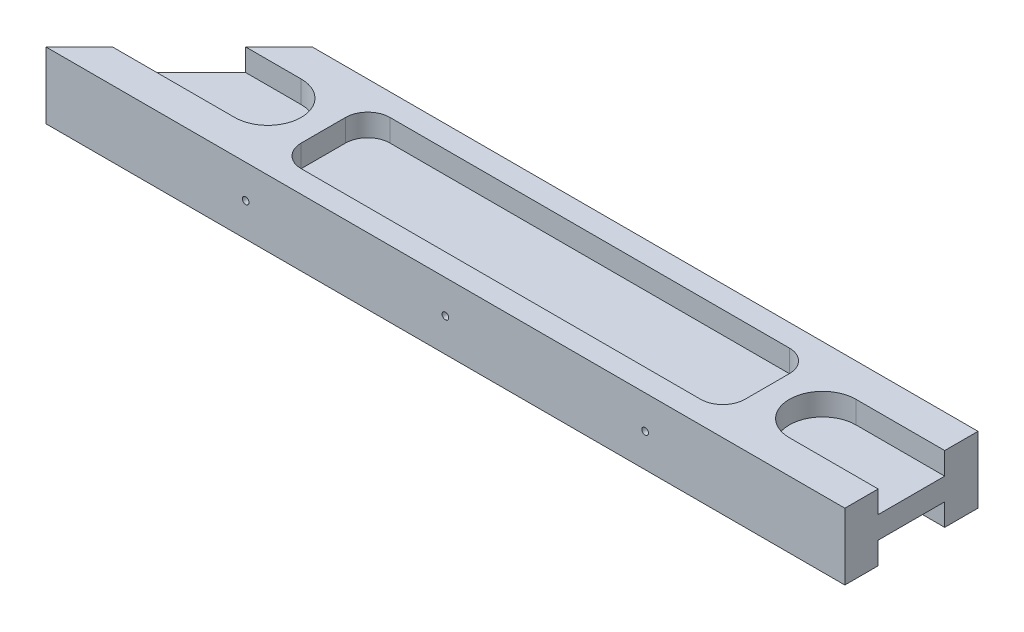
ISO-10303-21;
HEADER;
FILE_DESCRIPTION(('STEP AP214'),'2;1');
FILE_NAME('part.step','',(''),(''),'','','');
FILE_SCHEMA(('AUTOMOTIVE_DESIGN { 1 0 10303 214 1 1 1 1 }'));
ENDSEC;
DATA;
#1=APPLICATION_CONTEXT('core data for automotive mechanical design processes');
#2=APPLICATION_PROTOCOL_DEFINITION('international standard','automotive_design',2000,#1);
#3=PRODUCT_CONTEXT('',#1,'mechanical');
#4=PRODUCT('Part','Part','',(#3));
#5=PRODUCT_RELATED_PRODUCT_CATEGORY('part','',(#4));
#6=PRODUCT_DEFINITION_FORMATION('','',#4);
#7=PRODUCT_DEFINITION_CONTEXT('part definition',#1,'design');
#8=PRODUCT_DEFINITION('design','',#6,#7);
#9=PRODUCT_DEFINITION_SHAPE('','',#8);
#10=(LENGTH_UNIT() NAMED_UNIT(*) SI_UNIT(.MILLI.,.METRE.));
#11=(NAMED_UNIT(*) PLANE_ANGLE_UNIT() SI_UNIT($,.RADIAN.));
#12=(NAMED_UNIT(*) SI_UNIT($,.STERADIAN.) SOLID_ANGLE_UNIT());
#13=UNCERTAINTY_MEASURE_WITH_UNIT(LENGTH_MEASURE(1.E-05),#10,'distance_accuracy_value','');
#14=(GEOMETRIC_REPRESENTATION_CONTEXT(3) GLOBAL_UNCERTAINTY_ASSIGNED_CONTEXT((#13)) GLOBAL_UNIT_ASSIGNED_CONTEXT((#10,
#11,#12)) REPRESENTATION_CONTEXT('',''));
#15=CARTESIAN_POINT('',(0.,0.,0.));
#16=DIRECTION('',(0.,0.,1.));
#17=DIRECTION('',(1.,0.,0.));
#18=AXIS2_PLACEMENT_3D('',#15,#16,#17);
#19=CARTESIAN_POINT('',(30.,15.,-30.));
#20=DIRECTION('',(0.707106781186547,0.,0.707106781186548));
#21=DIRECTION('',(0.707106781186548,0.,-0.707106781186547));
#22=AXIS2_PLACEMENT_3D('',#19,#20,#21);
#23=PLANE('',#22);
#24=DIRECTION('',(-0.707106781186548,0.,0.707106781186547));
#25=VECTOR('',#24,1.);
#26=CARTESIAN_POINT('',(30.,0.,-30.));
#27=LINE('',#26,#25);
#28=CARTESIAN_POINT('',(30.,0.,-30.));
#29=VERTEX_POINT('',#28);
#30=CARTESIAN_POINT('',(22.5,0.,-22.5));
#31=VERTEX_POINT('',#30);
#32=EDGE_CURVE('E426',#29,#31,#27,.T.);
#33=ORIENTED_EDGE('',*,*,#32,.T.);
#34=DIRECTION('',(0.,-1.,0.));
#35=VECTOR('',#34,1.);
#36=CARTESIAN_POINT('',(22.5,5.,-22.5));
#37=LINE('',#36,#35);
#38=CARTESIAN_POINT('',(22.5,5.,-22.5));
#39=VERTEX_POINT('',#38);
#40=EDGE_CURVE('E346',#39,#31,#37,.T.);
#41=ORIENTED_EDGE('',*,*,#40,.F.);
#42=DIRECTION('',(0.707106781186548,0.,-0.707106781186547));
#43=VECTOR('',#42,1.);
#44=CARTESIAN_POINT('',(22.5,5.,-22.5));
#45=LINE('',#44,#43);
#46=CARTESIAN_POINT('',(7.50000000000001,5.,-7.5));
#47=VERTEX_POINT('',#46);
#48=EDGE_CURVE('E358',#47,#39,#45,.T.);
#49=ORIENTED_EDGE('',*,*,#48,.F.);
#50=DIRECTION('',(0.,-1.,0.));
#51=VECTOR('',#50,1.);
#52=CARTESIAN_POINT('',(7.50000000000001,5.,-7.5));
#53=LINE('',#52,#51);
#54=CARTESIAN_POINT('',(7.50000000000001,0.,-7.5));
#55=VERTEX_POINT('',#54);
#56=EDGE_CURVE('E343',#47,#55,#53,.T.);
#57=ORIENTED_EDGE('',*,*,#56,.T.);
#58=CARTESIAN_POINT('',(0.,0.,0.));
#59=VERTEX_POINT('',#58);
#60=EDGE_CURVE('E412',#55,#59,#27,.T.);
#61=ORIENTED_EDGE('',*,*,#60,.T.);
#62=DIRECTION('',(0.,-1.,0.));
#63=VECTOR('',#62,1.);
#64=CARTESIAN_POINT('',(0.,15.,0.));
#65=LINE('',#64,#63);
#66=CARTESIAN_POINT('',(0.,15.,0.));
#67=VERTEX_POINT('',#66);
#68=EDGE_CURVE('E445',#67,#59,#65,.T.);
#69=ORIENTED_EDGE('',*,*,#68,.F.);
#70=DIRECTION('',(-0.707106781186548,0.,0.707106781186547));
#71=VECTOR('',#70,1.);
#72=CARTESIAN_POINT('',(30.,15.,-30.));
#73=LINE('',#72,#71);
#74=CARTESIAN_POINT('',(7.5,15.,-7.49999999999999));
#75=VERTEX_POINT('',#74);
#76=EDGE_CURVE('E417',#75,#67,#73,.T.);
#77=ORIENTED_EDGE('',*,*,#76,.F.);
#78=DIRECTION('',(0.,-1.,0.));
#79=VECTOR('',#78,1.);
#80=CARTESIAN_POINT('',(7.5,15.,-7.5));
#81=LINE('',#80,#79);
#82=CARTESIAN_POINT('',(7.50000000000001,10.,-7.5));
#83=VERTEX_POINT('',#82);
#84=EDGE_CURVE('E406',#75,#83,#81,.T.);
#85=ORIENTED_EDGE('',*,*,#84,.T.);
#86=DIRECTION('',(-0.707106781186548,0.,0.707106781186547));
#87=VECTOR('',#86,1.);
#88=CARTESIAN_POINT('',(30.,10.,-30.));
#89=LINE('',#88,#87);
#90=CARTESIAN_POINT('',(22.5,10.,-22.5));
#91=VERTEX_POINT('',#90);
#92=EDGE_CURVE('E11',#91,#83,#89,.T.);
#93=ORIENTED_EDGE('',*,*,#92,.F.);
#94=DIRECTION('',(0.,1.,0.));
#95=VECTOR('',#94,1.);
#96=CARTESIAN_POINT('',(22.5,15.,-22.5));
#97=LINE('',#96,#95);
#98=CARTESIAN_POINT('',(22.5,15.,-22.5));
#99=VERTEX_POINT('',#98);
#100=EDGE_CURVE('E409',#91,#99,#97,.T.);
#101=ORIENTED_EDGE('',*,*,#100,.T.);
#102=CARTESIAN_POINT('',(30.,15.,-30.));
#103=VERTEX_POINT('',#102);
#104=EDGE_CURVE('E413',#103,#99,#73,.T.);
#105=ORIENTED_EDGE('',*,*,#104,.F.);
#106=DIRECTION('',(0.,-1.,0.));
#107=VECTOR('',#106,1.);
#108=CARTESIAN_POINT('',(30.,15.,-30.));
#109=LINE('',#108,#107);
#110=EDGE_CURVE('E425',#103,#29,#109,.T.);
#111=ORIENTED_EDGE('',*,*,#110,.T.);
#112=EDGE_LOOP('',(#33,#41,#49,#57,#61,#69,#77,#85,#93,#101,#105,#111));
#113=FACE_BOUND('',#112,.T.);
#114=ADVANCED_FACE('F39',(#113),#23,.F.);
#115=CARTESIAN_POINT('',(0.,15.,0.));
#116=DIRECTION('',(0.,0.,-1.));
#117=DIRECTION('',(-1.,0.,0.));
#118=AXIS2_PLACEMENT_3D('',#115,#116,#117);
#119=PLANE('',#118);
#120=CARTESIAN_POINT('',(135.,7.5,0.));
#121=DIRECTION('',(0.,0.,1.));
#122=DIRECTION('',(1.,0.,0.));
#123=AXIS2_PLACEMENT_3D('',#120,#121,#122);
#124=CIRCLE('',#123,0.750000000000012);
#125=CARTESIAN_POINT('',(135.75,7.5,0.));
#126=VERTEX_POINT('',#125);
#127=EDGE_CURVE('E297',#126,#126,#124,.T.);
#128=ORIENTED_EDGE('',*,*,#127,.F.);
#129=EDGE_LOOP('',(#128));
#130=FACE_BOUND('',#129,.T.);
#131=CARTESIAN_POINT('',(45.,7.5,0.));
#132=DIRECTION('',(0.,0.,1.));
#133=DIRECTION('',(1.,0.,0.));
#134=AXIS2_PLACEMENT_3D('',#131,#132,#133);
#135=CIRCLE('',#134,0.749999999999999);
#136=CARTESIAN_POINT('',(45.75,7.5,0.));
#137=VERTEX_POINT('',#136);
#138=EDGE_CURVE('E296',#137,#137,#135,.T.);
#139=ORIENTED_EDGE('',*,*,#138,.F.);
#140=EDGE_LOOP('',(#139));
#141=FACE_BOUND('',#140,.T.);
#142=CARTESIAN_POINT('',(90.,7.5,0.));
#143=DIRECTION('',(0.,0.,1.));
#144=DIRECTION('',(1.,0.,0.));
#145=AXIS2_PLACEMENT_3D('',#142,#143,#144);
#146=CIRCLE('',#145,0.749999999999999);
#147=CARTESIAN_POINT('',(90.75,7.5,0.));
#148=VERTEX_POINT('',#147);
#149=EDGE_CURVE('E300',#148,#148,#146,.T.);
#150=ORIENTED_EDGE('',*,*,#149,.F.);
#151=EDGE_LOOP('',(#150));
#152=FACE_BOUND('',#151,.T.);
#153=DIRECTION('',(1.,0.,0.));
#154=VECTOR('',#153,1.);
#155=CARTESIAN_POINT('',(0.,0.,0.));
#156=LINE('',#155,#154);
#157=CARTESIAN_POINT('',(180.,0.,0.));
#158=VERTEX_POINT('',#157);
#159=EDGE_CURVE('E429',#59,#158,#156,.T.);
#160=ORIENTED_EDGE('',*,*,#159,.T.);
#161=DIRECTION('',(0.,-1.,0.));
#162=VECTOR('',#161,1.);
#163=CARTESIAN_POINT('',(180.,15.,0.));
#164=LINE('',#163,#162);
#165=CARTESIAN_POINT('',(180.,15.,0.));
#166=VERTEX_POINT('',#165);
#167=EDGE_CURVE('E442',#166,#158,#164,.T.);
#168=ORIENTED_EDGE('',*,*,#167,.F.);
#169=DIRECTION('',(1.,0.,0.));
#170=VECTOR('',#169,1.);
#171=CARTESIAN_POINT('',(0.,15.,0.));
#172=LINE('',#171,#170);
#173=EDGE_CURVE('E416',#67,#166,#172,.T.);
#174=ORIENTED_EDGE('',*,*,#173,.F.);
#175=ORIENTED_EDGE('',*,*,#68,.T.);
#176=EDGE_LOOP('',(#160,#168,#174,#175));
#177=FACE_BOUND('',#176,.T.);
#178=ADVANCED_FACE('F521',(#130,#141,#152,#177),#119,.F.);
#179=CARTESIAN_POINT('',(180.,15.,0.));
#180=DIRECTION('',(-1.,0.,0.));
#181=DIRECTION('',(0.,0.,1.));
#182=AXIS2_PLACEMENT_3D('',#179,#180,#181);
#183=PLANE('',#182);
#184=DIRECTION('',(0.,0.,-1.));
#185=VECTOR('',#184,1.);
#186=CARTESIAN_POINT('',(180.,0.,0.));
#187=LINE('',#186,#185);
#188=CARTESIAN_POINT('',(180.,0.,-7.5));
#189=VERTEX_POINT('',#188);
#190=EDGE_CURVE('E432',#158,#189,#187,.T.);
#191=ORIENTED_EDGE('',*,*,#190,.T.);
#192=DIRECTION('',(0.,-1.,0.));
#193=VECTOR('',#192,1.);
#194=CARTESIAN_POINT('',(180.,5.,-7.5));
#195=LINE('',#194,#193);
#196=CARTESIAN_POINT('',(180.,5.,-7.5));
#197=VERTEX_POINT('',#196);
#198=EDGE_CURVE('E333',#197,#189,#195,.T.);
#199=ORIENTED_EDGE('',*,*,#198,.F.);
#200=DIRECTION('',(0.,0.,1.));
#201=VECTOR('',#200,1.);
#202=CARTESIAN_POINT('',(180.,5.,-7.5));
#203=LINE('',#202,#201);
#204=CARTESIAN_POINT('',(180.,5.,-22.5));
#205=VERTEX_POINT('',#204);
#206=EDGE_CURVE('E318',#205,#197,#203,.T.);
#207=ORIENTED_EDGE('',*,*,#206,.F.);
#208=DIRECTION('',(0.,-1.,0.));
#209=VECTOR('',#208,1.);
#210=CARTESIAN_POINT('',(180.,5.,-22.5));
#211=LINE('',#210,#209);
#212=CARTESIAN_POINT('',(180.,0.,-22.5));
#213=VERTEX_POINT('',#212);
#214=EDGE_CURVE('E335',#205,#213,#211,.T.);
#215=ORIENTED_EDGE('',*,*,#214,.T.);
#216=CARTESIAN_POINT('',(180.,0.,-30.));
#217=VERTEX_POINT('',#216);
#218=EDGE_CURVE('E431',#213,#217,#187,.T.);
#219=ORIENTED_EDGE('',*,*,#218,.T.);
#220=DIRECTION('',(0.,-1.,0.));
#221=VECTOR('',#220,1.);
#222=CARTESIAN_POINT('',(180.,15.,-30.));
#223=LINE('',#222,#221);
#224=CARTESIAN_POINT('',(180.,15.,-30.));
#225=VERTEX_POINT('',#224);
#226=EDGE_CURVE('E439',#225,#217,#223,.T.);
#227=ORIENTED_EDGE('',*,*,#226,.F.);
#228=DIRECTION('',(0.,0.,-1.));
#229=VECTOR('',#228,1.);
#230=CARTESIAN_POINT('',(180.,15.,0.));
#231=LINE('',#230,#229);
#232=CARTESIAN_POINT('',(180.,15.,-22.5));
#233=VERTEX_POINT('',#232);
#234=EDGE_CURVE('E419',#233,#225,#231,.T.);
#235=ORIENTED_EDGE('',*,*,#234,.F.);
#236=DIRECTION('',(0.,-1.,0.));
#237=VECTOR('',#236,1.);
#238=CARTESIAN_POINT('',(180.,15.,-22.5));
#239=LINE('',#238,#237);
#240=CARTESIAN_POINT('',(180.,10.,-22.5));
#241=VERTEX_POINT('',#240);
#242=EDGE_CURVE('E382',#233,#241,#239,.T.);
#243=ORIENTED_EDGE('',*,*,#242,.T.);
#244=DIRECTION('',(0.,0.,1.));
#245=VECTOR('',#244,1.);
#246=CARTESIAN_POINT('',(180.,10.,0.));
#247=LINE('',#246,#245);
#248=CARTESIAN_POINT('',(180.,10.,-7.5));
#249=VERTEX_POINT('',#248);
#250=EDGE_CURVE('E46',#241,#249,#247,.T.);
#251=ORIENTED_EDGE('',*,*,#250,.T.);
#252=DIRECTION('',(0.,1.,0.));
#253=VECTOR('',#252,1.);
#254=CARTESIAN_POINT('',(180.,15.,-7.5));
#255=LINE('',#254,#253);
#256=CARTESIAN_POINT('',(180.,15.,-7.5));
#257=VERTEX_POINT('',#256);
#258=EDGE_CURVE('E403',#249,#257,#255,.T.);
#259=ORIENTED_EDGE('',*,*,#258,.T.);
#260=EDGE_CURVE('E420',#166,#257,#231,.T.);
#261=ORIENTED_EDGE('',*,*,#260,.F.);
#262=ORIENTED_EDGE('',*,*,#167,.T.);
#263=EDGE_LOOP('',(#191,#199,#207,#215,#219,#227,#235,#243,#251,#259,#261,#262));
#264=FACE_BOUND('',#263,.T.);
#265=ADVANCED_FACE('F453',(#264),#183,.F.);
#266=CARTESIAN_POINT('',(180.,15.,-30.));
#267=DIRECTION('',(0.,0.,1.));
#268=DIRECTION('',(1.,0.,0.));
#269=AXIS2_PLACEMENT_3D('',#266,#267,#268);
#270=PLANE('',#269);
#271=CARTESIAN_POINT('',(135.,7.5,-30.));
#272=DIRECTION('',(0.,0.,1.));
#273=DIRECTION('',(1.,0.,0.));
#274=AXIS2_PLACEMENT_3D('',#271,#272,#273);
#275=CIRCLE('',#274,0.750000000000012);
#276=CARTESIAN_POINT('',(135.75,7.5,-30.));
#277=VERTEX_POINT('',#276);
#278=EDGE_CURVE('E281',#277,#277,#275,.F.);
#279=ORIENTED_EDGE('',*,*,#278,.F.);
#280=EDGE_LOOP('',(#279));
#281=FACE_BOUND('',#280,.T.);
#282=CARTESIAN_POINT('',(45.,7.5,-30.));
#283=DIRECTION('',(0.,0.,1.));
#284=DIRECTION('',(1.,0.,0.));
#285=AXIS2_PLACEMENT_3D('',#282,#283,#284);
#286=CIRCLE('',#285,0.749999999999999);
#287=CARTESIAN_POINT('',(45.75,7.5,-30.));
#288=VERTEX_POINT('',#287);
#289=EDGE_CURVE('E293',#288,#288,#286,.F.);
#290=ORIENTED_EDGE('',*,*,#289,.F.);
#291=EDGE_LOOP('',(#290));
#292=FACE_BOUND('',#291,.T.);
#293=CARTESIAN_POINT('',(90.,7.5,-30.));
#294=DIRECTION('',(0.,0.,1.));
#295=DIRECTION('',(1.,0.,0.));
#296=AXIS2_PLACEMENT_3D('',#293,#294,#295);
#297=CIRCLE('',#296,0.749999999999999);
#298=CARTESIAN_POINT('',(90.75,7.5,-30.));
#299=VERTEX_POINT('',#298);
#300=EDGE_CURVE('E307',#299,#299,#297,.F.);
#301=ORIENTED_EDGE('',*,*,#300,.F.);
#302=EDGE_LOOP('',(#301));
#303=FACE_BOUND('',#302,.T.);
#304=DIRECTION('',(-1.,0.,0.));
#305=VECTOR('',#304,1.);
#306=CARTESIAN_POINT('',(180.,0.,-30.));
#307=LINE('',#306,#305);
#308=EDGE_CURVE('E435',#217,#29,#307,.T.);
#309=ORIENTED_EDGE('',*,*,#308,.T.);
#310=ORIENTED_EDGE('',*,*,#110,.F.);
#311=DIRECTION('',(-1.,0.,0.));
#312=VECTOR('',#311,1.);
#313=CARTESIAN_POINT('',(180.,15.,-30.));
#314=LINE('',#313,#312);
#315=EDGE_CURVE('E423',#225,#103,#314,.T.);
#316=ORIENTED_EDGE('',*,*,#315,.F.);
#317=ORIENTED_EDGE('',*,*,#226,.T.);
#318=EDGE_LOOP('',(#309,#310,#316,#317));
#319=FACE_BOUND('',#318,.T.);
#320=ADVANCED_FACE('F501',(#281,#292,#303,#319),#270,.F.);
#321=CARTESIAN_POINT('',(0.,15.,0.));
#322=DIRECTION('',(0.,1.,0.));
#323=DIRECTION('',(0.,0.,1.));
#324=AXIS2_PLACEMENT_3D('',#321,#322,#323);
#325=PLANE('',#324);
#326=CARTESIAN_POINT('',(142.5,15.,-20.));
#327=DIRECTION('',(0.,1.,0.));
#328=DIRECTION('',(0.,0.,-1.));
#329=AXIS2_PLACEMENT_3D('',#326,#327,#328);
#330=CIRCLE('',#329,5.);
#331=CARTESIAN_POINT('',(147.5,15.,-20.));
#332=VERTEX_POINT('',#331);
#333=CARTESIAN_POINT('',(142.5,15.,-25.));
#334=VERTEX_POINT('',#333);
#335=EDGE_CURVE('E53',#332,#334,#330,.T.);
#336=ORIENTED_EDGE('',*,*,#335,.F.);
#337=DIRECTION('',(0.,0.,-1.));
#338=VECTOR('',#337,1.);
#339=CARTESIAN_POINT('',(147.5,15.,-20.));
#340=LINE('',#339,#338);
#341=CARTESIAN_POINT('',(147.5,15.,-10.));
#342=VERTEX_POINT('',#341);
#343=EDGE_CURVE('E243',#342,#332,#340,.T.);
#344=ORIENTED_EDGE('',*,*,#343,.F.);
#345=CARTESIAN_POINT('',(142.5,15.,-10.));
#346=DIRECTION('',(0.,1.,0.));
#347=DIRECTION('',(0.,0.,1.));
#348=AXIS2_PLACEMENT_3D('',#345,#346,#347);
#349=CIRCLE('',#348,5.);
#350=CARTESIAN_POINT('',(142.5,15.,-5.));
#351=VERTEX_POINT('',#350);
#352=EDGE_CURVE('E246',#351,#342,#349,.T.);
#353=ORIENTED_EDGE('',*,*,#352,.F.);
#354=DIRECTION('',(1.,0.,0.));
#355=VECTOR('',#354,1.);
#356=CARTESIAN_POINT('',(52.5,15.,-5.));
#357=LINE('',#356,#355);
#358=CARTESIAN_POINT('',(52.5,15.,-5.));
#359=VERTEX_POINT('',#358);
#360=EDGE_CURVE('E274',#359,#351,#357,.T.);
#361=ORIENTED_EDGE('',*,*,#360,.F.);
#362=CARTESIAN_POINT('',(52.5,15.,-10.));
#363=DIRECTION('',(0.,1.,0.));
#364=DIRECTION('',(0.,0.,1.));
#365=AXIS2_PLACEMENT_3D('',#362,#363,#364);
#366=CIRCLE('',#365,5.);
#367=CARTESIAN_POINT('',(47.5,15.,-10.));
#368=VERTEX_POINT('',#367);
#369=EDGE_CURVE('E271',#368,#359,#366,.T.);
#370=ORIENTED_EDGE('',*,*,#369,.F.);
#371=DIRECTION('',(0.,0.,1.));
#372=VECTOR('',#371,1.);
#373=CARTESIAN_POINT('',(47.5,15.,-20.));
#374=LINE('',#373,#372);
#375=CARTESIAN_POINT('',(47.5,15.,-20.));
#376=VERTEX_POINT('',#375);
#377=EDGE_CURVE('E268',#376,#368,#374,.T.);
#378=ORIENTED_EDGE('',*,*,#377,.F.);
#379=CARTESIAN_POINT('',(52.5,15.,-20.));
#380=DIRECTION('',(0.,1.,0.));
#381=DIRECTION('',(0.,0.,1.));
#382=AXIS2_PLACEMENT_3D('',#379,#380,#381);
#383=CIRCLE('',#382,5.);
#384=CARTESIAN_POINT('',(52.5,15.,-25.));
#385=VERTEX_POINT('',#384);
#386=EDGE_CURVE('E265',#385,#376,#383,.T.);
#387=ORIENTED_EDGE('',*,*,#386,.F.);
#388=DIRECTION('',(-1.,0.,0.));
#389=VECTOR('',#388,1.);
#390=CARTESIAN_POINT('',(52.5,15.,-25.));
#391=LINE('',#390,#389);
#392=EDGE_CURVE('E263',#334,#385,#391,.T.);
#393=ORIENTED_EDGE('',*,*,#392,.F.);
#394=EDGE_LOOP('',(#336,#344,#353,#361,#370,#378,#387,#393));
#395=FACE_BOUND('',#394,.T.);
#396=DIRECTION('',(-1.,0.,0.));
#397=VECTOR('',#396,1.);
#398=CARTESIAN_POINT('',(-5.,15.,-22.5));
#399=LINE('',#398,#397);
#400=CARTESIAN_POINT('',(35.,15.,-22.5));
#401=VERTEX_POINT('',#400);
#402=EDGE_CURVE('E368',#401,#99,#399,.T.);
#403=ORIENTED_EDGE('',*,*,#402,.F.);
#404=CARTESIAN_POINT('',(35.,15.,-15.));
#405=DIRECTION('',(0.,1.,0.));
#406=DIRECTION('',(0.,0.,1.));
#407=AXIS2_PLACEMENT_3D('',#404,#405,#406);
#408=CIRCLE('',#407,7.5);
#409=CARTESIAN_POINT('',(35.,15.,-7.5));
#410=VERTEX_POINT('',#409);
#411=EDGE_CURVE('E375',#410,#401,#408,.T.);
#412=ORIENTED_EDGE('',*,*,#411,.F.);
#413=DIRECTION('',(1.,0.,0.));
#414=VECTOR('',#413,1.);
#415=CARTESIAN_POINT('',(0.,15.,-7.49999999999999));
#416=LINE('',#415,#414);
#417=EDGE_CURVE('E450',#75,#410,#416,.T.);
#418=ORIENTED_EDGE('',*,*,#417,.F.);
#419=ORIENTED_EDGE('',*,*,#76,.T.);
#420=ORIENTED_EDGE('',*,*,#173,.T.);
#421=ORIENTED_EDGE('',*,*,#260,.T.);
#422=DIRECTION('',(1.,0.,0.));
#423=VECTOR('',#422,1.);
#424=CARTESIAN_POINT('',(200.,15.,-7.5));
#425=LINE('',#424,#423);
#426=CARTESIAN_POINT('',(160.,15.,-7.5));
#427=VERTEX_POINT('',#426);
#428=EDGE_CURVE('E390',#427,#257,#425,.T.);
#429=ORIENTED_EDGE('',*,*,#428,.F.);
#430=CARTESIAN_POINT('',(160.,15.,-15.));
#431=DIRECTION('',(0.,1.,0.));
#432=DIRECTION('',(0.,0.,-1.));
#433=AXIS2_PLACEMENT_3D('',#430,#431,#432);
#434=CIRCLE('',#433,7.5);
#435=CARTESIAN_POINT('',(160.,15.,-22.5));
#436=VERTEX_POINT('',#435);
#437=EDGE_CURVE('E378',#436,#427,#434,.T.);
#438=ORIENTED_EDGE('',*,*,#437,.F.);
#439=DIRECTION('',(-1.,0.,0.));
#440=VECTOR('',#439,1.);
#441=CARTESIAN_POINT('',(0.,15.,-22.5));
#442=LINE('',#441,#440);
#443=EDGE_CURVE('E448',#233,#436,#442,.T.);
#444=ORIENTED_EDGE('',*,*,#443,.F.);
#445=ORIENTED_EDGE('',*,*,#234,.T.);
#446=ORIENTED_EDGE('',*,*,#315,.T.);
#447=ORIENTED_EDGE('',*,*,#104,.T.);
#448=EDGE_LOOP('',(#403,#412,#418,#419,#420,#421,#429,#438,#444,#445,#446,#447));
#449=FACE_BOUND('',#448,.T.);
#450=ADVANCED_FACE('F473',(#395,#449),#325,.T.);
#451=CARTESIAN_POINT('',(0.,0.,0.));
#452=DIRECTION('',(0.,1.,0.));
#453=DIRECTION('',(0.,0.,1.));
#454=AXIS2_PLACEMENT_3D('',#451,#452,#453);
#455=PLANE('',#454);
#456=CARTESIAN_POINT('',(160.,0.,-15.));
#457=DIRECTION('',(0.,-1.,0.));
#458=DIRECTION('',(0.,0.,-1.));
#459=AXIS2_PLACEMENT_3D('',#456,#457,#458);
#460=CIRCLE('',#459,7.5);
#461=CARTESIAN_POINT('',(160.,0.,-7.5));
#462=VERTEX_POINT('',#461);
#463=CARTESIAN_POINT('',(160.,0.,-22.5));
#464=VERTEX_POINT('',#463);
#465=EDGE_CURVE('E61',#462,#464,#460,.T.);
#466=ORIENTED_EDGE('',*,*,#465,.F.);
#467=DIRECTION('',(-1.,0.,0.));
#468=VECTOR('',#467,1.);
#469=CARTESIAN_POINT('',(160.,0.,-7.5));
#470=LINE('',#469,#468);
#471=EDGE_CURVE('E315',#189,#462,#470,.T.);
#472=ORIENTED_EDGE('',*,*,#471,.F.);
#473=ORIENTED_EDGE('',*,*,#190,.F.);
#474=ORIENTED_EDGE('',*,*,#159,.F.);
#475=ORIENTED_EDGE('',*,*,#60,.F.);
#476=DIRECTION('',(-1.,0.,0.));
#477=VECTOR('',#476,1.);
#478=CARTESIAN_POINT('',(7.50000000000001,0.,-7.5));
#479=LINE('',#478,#477);
#480=CARTESIAN_POINT('',(35.,0.,-7.5));
#481=VERTEX_POINT('',#480);
#482=EDGE_CURVE('E352',#481,#55,#479,.T.);
#483=ORIENTED_EDGE('',*,*,#482,.F.);
#484=CARTESIAN_POINT('',(35.,0.,-15.));
#485=DIRECTION('',(0.,-1.,0.));
#486=DIRECTION('',(0.,0.,-1.));
#487=AXIS2_PLACEMENT_3D('',#484,#485,#486);
#488=CIRCLE('',#487,7.5);
#489=CARTESIAN_POINT('',(35.,0.,-22.5));
#490=VERTEX_POINT('',#489);
#491=EDGE_CURVE('E326',#490,#481,#488,.T.);
#492=ORIENTED_EDGE('',*,*,#491,.F.);
#493=DIRECTION('',(1.,0.,0.));
#494=VECTOR('',#493,1.);
#495=CARTESIAN_POINT('',(35.,0.,-22.5));
#496=LINE('',#495,#494);
#497=EDGE_CURVE('E349',#31,#490,#496,.T.);
#498=ORIENTED_EDGE('',*,*,#497,.F.);
#499=ORIENTED_EDGE('',*,*,#32,.F.);
#500=ORIENTED_EDGE('',*,*,#308,.F.);
#501=ORIENTED_EDGE('',*,*,#218,.F.);
#502=DIRECTION('',(1.,0.,0.));
#503=VECTOR('',#502,1.);
#504=CARTESIAN_POINT('',(180.,0.,-22.5));
#505=LINE('',#504,#503);
#506=EDGE_CURVE('E325',#464,#213,#505,.T.);
#507=ORIENTED_EDGE('',*,*,#506,.F.);
#508=EDGE_LOOP('',(#466,#472,#473,#474,#475,#483,#492,#498,#499,#500,#501,#507));
#509=FACE_BOUND('',#508,.T.);
#510=ADVANCED_FACE('F482',(#509),#455,.F.);
#511=CARTESIAN_POINT('',(200.,10.,-15.));
#512=DIRECTION('',(0.,-1.,0.));
#513=DIRECTION('',(0.,0.,-1.));
#514=AXIS2_PLACEMENT_3D('',#511,#512,#513);
#515=PLANE('',#514);
#516=DIRECTION('',(-1.,0.,0.));
#517=VECTOR('',#516,1.);
#518=CARTESIAN_POINT('',(200.,10.,-22.5));
#519=LINE('',#518,#517);
#520=CARTESIAN_POINT('',(160.,10.,-22.5));
#521=VERTEX_POINT('',#520);
#522=EDGE_CURVE('E392',#241,#521,#519,.T.);
#523=ORIENTED_EDGE('',*,*,#522,.T.);
#524=CARTESIAN_POINT('',(160.,10.,-15.));
#525=DIRECTION('',(0.,1.,0.));
#526=DIRECTION('',(0.,0.,-1.));
#527=AXIS2_PLACEMENT_3D('',#524,#525,#526);
#528=CIRCLE('',#527,7.5);
#529=CARTESIAN_POINT('',(160.,10.,-7.5));
#530=VERTEX_POINT('',#529);
#531=EDGE_CURVE('E397',#521,#530,#528,.T.);
#532=ORIENTED_EDGE('',*,*,#531,.T.);
#533=DIRECTION('',(1.,0.,0.));
#534=VECTOR('',#533,1.);
#535=CARTESIAN_POINT('',(200.,10.,-7.5));
#536=LINE('',#535,#534);
#537=EDGE_CURVE('E388',#530,#249,#536,.T.);
#538=ORIENTED_EDGE('',*,*,#537,.T.);
#539=ORIENTED_EDGE('',*,*,#250,.F.);
#540=EDGE_LOOP('',(#523,#532,#538,#539));
#541=FACE_BOUND('',#540,.T.);
#542=ADVANCED_FACE('F458',(#541),#515,.F.);
#543=CARTESIAN_POINT('',(200.,10.,-7.5));
#544=DIRECTION('',(0.,0.,1.));
#545=DIRECTION('',(1.,0.,0.));
#546=AXIS2_PLACEMENT_3D('',#543,#544,#545);
#547=PLANE('',#546);
#548=ORIENTED_EDGE('',*,*,#537,.F.);
#549=DIRECTION('',(0.,1.,0.));
#550=VECTOR('',#549,1.);
#551=CARTESIAN_POINT('',(160.,10.,-7.5));
#552=LINE('',#551,#550);
#553=EDGE_CURVE('E332',#530,#427,#552,.T.);
#554=ORIENTED_EDGE('',*,*,#553,.T.);
#555=ORIENTED_EDGE('',*,*,#428,.T.);
#556=ORIENTED_EDGE('',*,*,#258,.F.);
#557=EDGE_LOOP('',(#548,#554,#555,#556));
#558=FACE_BOUND('',#557,.T.);
#559=ADVANCED_FACE('F469',(#558),#547,.F.);
#560=CARTESIAN_POINT('',(200.,10.,-22.5));
#561=DIRECTION('',(0.,0.,-1.));
#562=DIRECTION('',(-1.,0.,0.));
#563=AXIS2_PLACEMENT_3D('',#560,#561,#562);
#564=PLANE('',#563);
#565=ORIENTED_EDGE('',*,*,#443,.T.);
#566=DIRECTION('',(0.,1.,0.));
#567=VECTOR('',#566,1.);
#568=CARTESIAN_POINT('',(160.,10.,-22.5));
#569=LINE('',#568,#567);
#570=EDGE_CURVE('E385',#521,#436,#569,.T.);
#571=ORIENTED_EDGE('',*,*,#570,.F.);
#572=ORIENTED_EDGE('',*,*,#522,.F.);
#573=ORIENTED_EDGE('',*,*,#242,.F.);
#574=EDGE_LOOP('',(#565,#571,#572,#573));
#575=FACE_BOUND('',#574,.T.);
#576=ADVANCED_FACE('F462',(#575),#564,.F.);
#577=CARTESIAN_POINT('',(160.,10.,-15.));
#578=DIRECTION('',(0.,1.,0.));
#579=DIRECTION('',(0.,0.,1.));
#580=AXIS2_PLACEMENT_3D('',#577,#578,#579);
#581=CYLINDRICAL_SURFACE('',#580,7.5);
#582=ORIENTED_EDGE('',*,*,#437,.T.);
#583=ORIENTED_EDGE('',*,*,#553,.F.);
#584=ORIENTED_EDGE('',*,*,#531,.F.);
#585=ORIENTED_EDGE('',*,*,#570,.T.);
#586=EDGE_LOOP('',(#582,#583,#584,#585));
#587=FACE_BOUND('',#586,.T.);
#588=ADVANCED_FACE('F467',(#587),#581,.F.);
#589=CARTESIAN_POINT('',(-5.,10.,-15.));
#590=DIRECTION('',(0.,1.,0.));
#591=DIRECTION('',(0.,0.,1.));
#592=AXIS2_PLACEMENT_3D('',#589,#590,#591);
#593=PLANE('',#592);
#594=ORIENTED_EDGE('',*,*,#92,.T.);
#595=DIRECTION('',(1.,0.,0.));
#596=VECTOR('',#595,1.);
#597=CARTESIAN_POINT('',(-5.,10.,-7.49999999999999));
#598=LINE('',#597,#596);
#599=CARTESIAN_POINT('',(35.,10.,-7.5));
#600=VERTEX_POINT('',#599);
#601=EDGE_CURVE('E365',#83,#600,#598,.T.);
#602=ORIENTED_EDGE('',*,*,#601,.T.);
#603=CARTESIAN_POINT('',(35.,10.,-15.));
#604=DIRECTION('',(0.,1.,0.));
#605=DIRECTION('',(0.,0.,1.));
#606=AXIS2_PLACEMENT_3D('',#603,#604,#605);
#607=CIRCLE('',#606,7.5);
#608=CARTESIAN_POINT('',(35.,10.,-22.5));
#609=VERTEX_POINT('',#608);
#610=EDGE_CURVE('E367',#600,#609,#607,.T.);
#611=ORIENTED_EDGE('',*,*,#610,.T.);
#612=DIRECTION('',(-1.,0.,0.));
#613=VECTOR('',#612,1.);
#614=CARTESIAN_POINT('',(-5.,10.,-22.5));
#615=LINE('',#614,#613);
#616=EDGE_CURVE('E371',#609,#91,#615,.T.);
#617=ORIENTED_EDGE('',*,*,#616,.T.);
#618=EDGE_LOOP('',(#594,#602,#611,#617));
#619=FACE_BOUND('',#618,.T.);
#620=ADVANCED_FACE('F511',(#619),#593,.T.);
#621=CARTESIAN_POINT('',(-5.,10.,-22.5));
#622=DIRECTION('',(0.,0.,-1.));
#623=DIRECTION('',(-1.,0.,0.));
#624=AXIS2_PLACEMENT_3D('',#621,#622,#623);
#625=PLANE('',#624);
#626=ORIENTED_EDGE('',*,*,#616,.F.);
#627=DIRECTION('',(0.,1.,0.));
#628=VECTOR('',#627,1.);
#629=CARTESIAN_POINT('',(35.,10.,-22.5));
#630=LINE('',#629,#628);
#631=EDGE_CURVE('E380',#609,#401,#630,.T.);
#632=ORIENTED_EDGE('',*,*,#631,.T.);
#633=ORIENTED_EDGE('',*,*,#402,.T.);
#634=ORIENTED_EDGE('',*,*,#100,.F.);
#635=EDGE_LOOP('',(#626,#632,#633,#634));
#636=FACE_BOUND('',#635,.T.);
#637=ADVANCED_FACE('F509',(#636),#625,.F.);
#638=CARTESIAN_POINT('',(-5.,10.,-7.49999999999999));
#639=DIRECTION('',(0.,0.,1.));
#640=DIRECTION('',(1.,0.,0.));
#641=AXIS2_PLACEMENT_3D('',#638,#639,#640);
#642=PLANE('',#641);
#643=ORIENTED_EDGE('',*,*,#417,.T.);
#644=DIRECTION('',(0.,1.,0.));
#645=VECTOR('',#644,1.);
#646=CARTESIAN_POINT('',(35.,10.,-7.5));
#647=LINE('',#646,#645);
#648=EDGE_CURVE('E374',#600,#410,#647,.T.);
#649=ORIENTED_EDGE('',*,*,#648,.F.);
#650=ORIENTED_EDGE('',*,*,#601,.F.);
#651=ORIENTED_EDGE('',*,*,#84,.F.);
#652=EDGE_LOOP('',(#643,#649,#650,#651));
#653=FACE_BOUND('',#652,.T.);
#654=ADVANCED_FACE('F549',(#653),#642,.F.);
#655=CARTESIAN_POINT('',(35.,10.,-15.));
#656=DIRECTION('',(0.,1.,0.));
#657=DIRECTION('',(0.,0.,1.));
#658=AXIS2_PLACEMENT_3D('',#655,#656,#657);
#659=CYLINDRICAL_SURFACE('',#658,7.5);
#660=ORIENTED_EDGE('',*,*,#411,.T.);
#661=ORIENTED_EDGE('',*,*,#631,.F.);
#662=ORIENTED_EDGE('',*,*,#610,.F.);
#663=ORIENTED_EDGE('',*,*,#648,.T.);
#664=EDGE_LOOP('',(#660,#661,#662,#663));
#665=FACE_BOUND('',#664,.T.);
#666=ADVANCED_FACE('F516',(#665),#659,.F.);
#667=CARTESIAN_POINT('',(35.,5.,-15.));
#668=DIRECTION('',(0.,-1.,0.));
#669=DIRECTION('',(0.,0.,-1.));
#670=AXIS2_PLACEMENT_3D('',#667,#668,#669);
#671=CYLINDRICAL_SURFACE('',#670,7.5);
#672=ORIENTED_EDGE('',*,*,#491,.T.);
#673=DIRECTION('',(0.,-1.,0.));
#674=VECTOR('',#673,1.);
#675=CARTESIAN_POINT('',(35.,5.,-7.5));
#676=LINE('',#675,#674);
#677=CARTESIAN_POINT('',(35.,5.,-7.5));
#678=VERTEX_POINT('',#677);
#679=EDGE_CURVE('E339',#678,#481,#676,.T.);
#680=ORIENTED_EDGE('',*,*,#679,.F.);
#681=CARTESIAN_POINT('',(35.,5.,-15.));
#682=DIRECTION('',(0.,-1.,0.));
#683=DIRECTION('',(0.,0.,-1.));
#684=AXIS2_PLACEMENT_3D('',#681,#682,#683);
#685=CIRCLE('',#684,7.5);
#686=CARTESIAN_POINT('',(35.,5.,-22.5));
#687=VERTEX_POINT('',#686);
#688=EDGE_CURVE('E353',#687,#678,#685,.T.);
#689=ORIENTED_EDGE('',*,*,#688,.F.);
#690=DIRECTION('',(0.,-1.,0.));
#691=VECTOR('',#690,1.);
#692=CARTESIAN_POINT('',(35.,5.,-22.5));
#693=LINE('',#692,#691);
#694=EDGE_CURVE('E310',#687,#490,#693,.T.);
#695=ORIENTED_EDGE('',*,*,#694,.T.);
#696=EDGE_LOOP('',(#672,#680,#689,#695));
#697=FACE_BOUND('',#696,.T.);
#698=ADVANCED_FACE('F554',(#697),#671,.F.);
#699=CARTESIAN_POINT('',(35.,5.,-22.5));
#700=DIRECTION('',(0.,0.,-1.));
#701=DIRECTION('',(-1.,0.,0.));
#702=AXIS2_PLACEMENT_3D('',#699,#700,#701);
#703=PLANE('',#702);
#704=ORIENTED_EDGE('',*,*,#497,.T.);
#705=ORIENTED_EDGE('',*,*,#694,.F.);
#706=DIRECTION('',(1.,0.,0.));
#707=VECTOR('',#706,1.);
#708=CARTESIAN_POINT('',(35.,5.,-22.5));
#709=LINE('',#708,#707);
#710=EDGE_CURVE('E342',#39,#687,#709,.T.);
#711=ORIENTED_EDGE('',*,*,#710,.F.);
#712=ORIENTED_EDGE('',*,*,#40,.T.);
#713=EDGE_LOOP('',(#704,#705,#711,#712));
#714=FACE_BOUND('',#713,.T.);
#715=ADVANCED_FACE('F565',(#714),#703,.F.);
#716=CARTESIAN_POINT('',(7.50000000000001,5.,-7.5));
#717=DIRECTION('',(0.,0.,1.));
#718=DIRECTION('',(1.,0.,0.));
#719=AXIS2_PLACEMENT_3D('',#716,#717,#718);
#720=PLANE('',#719);
#721=ORIENTED_EDGE('',*,*,#482,.T.);
#722=ORIENTED_EDGE('',*,*,#56,.F.);
#723=DIRECTION('',(-1.,0.,0.));
#724=VECTOR('',#723,1.);
#725=CARTESIAN_POINT('',(7.50000000000001,5.,-7.5));
#726=LINE('',#725,#724);
#727=EDGE_CURVE('E360',#678,#47,#726,.T.);
#728=ORIENTED_EDGE('',*,*,#727,.F.);
#729=ORIENTED_EDGE('',*,*,#679,.T.);
#730=EDGE_LOOP('',(#721,#722,#728,#729));
#731=FACE_BOUND('',#730,.T.);
#732=ADVANCED_FACE('F563',(#731),#720,.F.);
#733=CARTESIAN_POINT('',(35.,5.,-15.));
#734=DIRECTION('',(0.,-1.,0.));
#735=DIRECTION('',(0.,0.,-1.));
#736=AXIS2_PLACEMENT_3D('',#733,#734,#735);
#737=PLANE('',#736);
#738=ORIENTED_EDGE('',*,*,#688,.T.);
#739=ORIENTED_EDGE('',*,*,#727,.T.);
#740=ORIENTED_EDGE('',*,*,#48,.T.);
#741=ORIENTED_EDGE('',*,*,#710,.T.);
#742=EDGE_LOOP('',(#738,#739,#740,#741));
#743=FACE_BOUND('',#742,.T.);
#744=ADVANCED_FACE('F559',(#743),#737,.T.);
#745=CARTESIAN_POINT('',(160.,5.,-15.));
#746=DIRECTION('',(0.,-1.,0.));
#747=DIRECTION('',(0.,0.,-1.));
#748=AXIS2_PLACEMENT_3D('',#745,#746,#747);
#749=CYLINDRICAL_SURFACE('',#748,7.5);
#750=ORIENTED_EDGE('',*,*,#465,.T.);
#751=DIRECTION('',(0.,-1.,0.));
#752=VECTOR('',#751,1.);
#753=CARTESIAN_POINT('',(160.,5.,-22.5));
#754=LINE('',#753,#752);
#755=CARTESIAN_POINT('',(160.,5.,-22.5));
#756=VERTEX_POINT('',#755);
#757=EDGE_CURVE('E323',#756,#464,#754,.T.);
#758=ORIENTED_EDGE('',*,*,#757,.F.);
#759=CARTESIAN_POINT('',(160.,5.,-15.));
#760=DIRECTION('',(0.,-1.,0.));
#761=DIRECTION('',(0.,0.,-1.));
#762=AXIS2_PLACEMENT_3D('',#759,#760,#761);
#763=CIRCLE('',#762,7.5);
#764=CARTESIAN_POINT('',(160.,5.,-7.5));
#765=VERTEX_POINT('',#764);
#766=EDGE_CURVE('E311',#765,#756,#763,.T.);
#767=ORIENTED_EDGE('',*,*,#766,.F.);
#768=DIRECTION('',(0.,-1.,0.));
#769=VECTOR('',#768,1.);
#770=CARTESIAN_POINT('',(160.,5.,-7.5));
#771=LINE('',#770,#769);
#772=EDGE_CURVE('E330',#765,#462,#771,.T.);
#773=ORIENTED_EDGE('',*,*,#772,.T.);
#774=EDGE_LOOP('',(#750,#758,#767,#773));
#775=FACE_BOUND('',#774,.T.);
#776=ADVANCED_FACE('F562',(#775),#749,.F.);
#777=CARTESIAN_POINT('',(160.,5.,-7.5));
#778=DIRECTION('',(0.,0.,1.));
#779=DIRECTION('',(1.,0.,0.));
#780=AXIS2_PLACEMENT_3D('',#777,#778,#779);
#781=PLANE('',#780);
#782=ORIENTED_EDGE('',*,*,#471,.T.);
#783=ORIENTED_EDGE('',*,*,#772,.F.);
#784=DIRECTION('',(-1.,0.,0.));
#785=VECTOR('',#784,1.);
#786=CARTESIAN_POINT('',(160.,5.,-7.5));
#787=LINE('',#786,#785);
#788=EDGE_CURVE('E320',#197,#765,#787,.T.);
#789=ORIENTED_EDGE('',*,*,#788,.F.);
#790=ORIENTED_EDGE('',*,*,#198,.T.);
#791=EDGE_LOOP('',(#782,#783,#789,#790));
#792=FACE_BOUND('',#791,.T.);
#793=ADVANCED_FACE('F486',(#792),#781,.F.);
#794=CARTESIAN_POINT('',(180.,5.,-22.5));
#795=DIRECTION('',(0.,0.,-1.));
#796=DIRECTION('',(-1.,0.,0.));
#797=AXIS2_PLACEMENT_3D('',#794,#795,#796);
#798=PLANE('',#797);
#799=ORIENTED_EDGE('',*,*,#506,.T.);
#800=ORIENTED_EDGE('',*,*,#214,.F.);
#801=DIRECTION('',(1.,0.,0.));
#802=VECTOR('',#801,1.);
#803=CARTESIAN_POINT('',(180.,5.,-22.5));
#804=LINE('',#803,#802);
#805=EDGE_CURVE('E314',#756,#205,#804,.T.);
#806=ORIENTED_EDGE('',*,*,#805,.F.);
#807=ORIENTED_EDGE('',*,*,#757,.T.);
#808=EDGE_LOOP('',(#799,#800,#806,#807));
#809=FACE_BOUND('',#808,.T.);
#810=ADVANCED_FACE('F495',(#809),#798,.F.);
#811=CARTESIAN_POINT('',(160.,5.,-15.));
#812=DIRECTION('',(0.,-1.,0.));
#813=DIRECTION('',(0.,0.,-1.));
#814=AXIS2_PLACEMENT_3D('',#811,#812,#813);
#815=PLANE('',#814);
#816=ORIENTED_EDGE('',*,*,#766,.T.);
#817=ORIENTED_EDGE('',*,*,#805,.T.);
#818=ORIENTED_EDGE('',*,*,#206,.T.);
#819=ORIENTED_EDGE('',*,*,#788,.T.);
#820=EDGE_LOOP('',(#816,#817,#818,#819));
#821=FACE_BOUND('',#820,.T.);
#822=ADVANCED_FACE('F492',(#821),#815,.T.);
#823=CARTESIAN_POINT('',(90.,7.5,-32.1213203435597));
#824=DIRECTION('',(0.,0.,1.));
#825=DIRECTION('',(1.,0.,0.));
#826=AXIS2_PLACEMENT_3D('',#823,#824,#825);
#827=CYLINDRICAL_SURFACE('',#826,0.749999999999999);
#828=ORIENTED_EDGE('',*,*,#300,.T.);
#829=EDGE_LOOP('',(#828));
#830=FACE_BOUND('',#829,.T.);
#831=ORIENTED_EDGE('',*,*,#149,.T.);
#832=EDGE_LOOP('',(#831));
#833=FACE_BOUND('',#832,.T.);
#834=ADVANCED_FACE('F582',(#830,#833),#827,.F.);
#835=CARTESIAN_POINT('',(45.,7.5,-32.1213203435597));
#836=DIRECTION('',(0.,0.,1.));
#837=DIRECTION('',(1.,0.,0.));
#838=AXIS2_PLACEMENT_3D('',#835,#836,#837);
#839=CYLINDRICAL_SURFACE('',#838,0.749999999999999);
#840=ORIENTED_EDGE('',*,*,#289,.T.);
#841=EDGE_LOOP('',(#840));
#842=FACE_BOUND('',#841,.T.);
#843=ORIENTED_EDGE('',*,*,#138,.T.);
#844=EDGE_LOOP('',(#843));
#845=FACE_BOUND('',#844,.T.);
#846=ADVANCED_FACE('F585',(#842,#845),#839,.F.);
#847=CARTESIAN_POINT('',(135.,7.5,-32.1213203435597));
#848=DIRECTION('',(0.,0.,1.));
#849=DIRECTION('',(1.,0.,0.));
#850=AXIS2_PLACEMENT_3D('',#847,#848,#849);
#851=CYLINDRICAL_SURFACE('',#850,0.750000000000012);
#852=ORIENTED_EDGE('',*,*,#278,.T.);
#853=EDGE_LOOP('',(#852));
#854=FACE_BOUND('',#853,.T.);
#855=ORIENTED_EDGE('',*,*,#127,.T.);
#856=EDGE_LOOP('',(#855));
#857=FACE_BOUND('',#856,.T.);
#858=ADVANCED_FACE('F587',(#854,#857),#851,.F.);
#859=CARTESIAN_POINT('',(142.5,10.,-20.));
#860=DIRECTION('',(0.,1.,0.));
#861=DIRECTION('',(0.,0.,1.));
#862=AXIS2_PLACEMENT_3D('',#859,#860,#861);
#863=CYLINDRICAL_SURFACE('',#862,5.);
#864=ORIENTED_EDGE('',*,*,#335,.T.);
#865=DIRECTION('',(0.,1.,0.));
#866=VECTOR('',#865,1.);
#867=CARTESIAN_POINT('',(142.5,10.,-25.));
#868=LINE('',#867,#866);
#869=CARTESIAN_POINT('',(142.5,10.,-25.));
#870=VERTEX_POINT('',#869);
#871=EDGE_CURVE('E220',#870,#334,#868,.T.);
#872=ORIENTED_EDGE('',*,*,#871,.F.);
#873=CARTESIAN_POINT('',(142.5,10.,-20.));
#874=DIRECTION('',(0.,1.,0.));
#875=DIRECTION('',(0.,0.,-1.));
#876=AXIS2_PLACEMENT_3D('',#873,#874,#875);
#877=CIRCLE('',#876,5.);
#878=CARTESIAN_POINT('',(147.5,10.,-20.));
#879=VERTEX_POINT('',#878);
#880=EDGE_CURVE('E224',#879,#870,#877,.T.);
#881=ORIENTED_EDGE('',*,*,#880,.F.);
#882=DIRECTION('',(0.,1.,0.));
#883=VECTOR('',#882,1.);
#884=CARTESIAN_POINT('',(147.5,10.,-20.));
#885=LINE('',#884,#883);
#886=EDGE_CURVE('E279',#879,#332,#885,.T.);
#887=ORIENTED_EDGE('',*,*,#886,.T.);
#888=EDGE_LOOP('',(#864,#872,#881,#887));
#889=FACE_BOUND('',#888,.T.);
#890=ADVANCED_FACE('F222',(#889),#863,.F.);
#891=CARTESIAN_POINT('',(147.5,10.,-20.));
#892=DIRECTION('',(1.,0.,0.));
#893=DIRECTION('',(0.,0.,-1.));
#894=AXIS2_PLACEMENT_3D('',#891,#892,#893);
#895=PLANE('',#894);
#896=ORIENTED_EDGE('',*,*,#343,.T.);
#897=ORIENTED_EDGE('',*,*,#886,.F.);
#898=DIRECTION('',(0.,0.,-1.));
#899=VECTOR('',#898,1.);
#900=CARTESIAN_POINT('',(147.5,10.,-20.));
#901=LINE('',#900,#899);
#902=CARTESIAN_POINT('',(147.5,10.,-10.));
#903=VERTEX_POINT('',#902);
#904=EDGE_CURVE('E230',#903,#879,#901,.T.);
#905=ORIENTED_EDGE('',*,*,#904,.F.);
#906=DIRECTION('',(0.,1.,0.));
#907=VECTOR('',#906,1.);
#908=CARTESIAN_POINT('',(147.5,10.,-10.));
#909=LINE('',#908,#907);
#910=EDGE_CURVE('E282',#903,#342,#909,.T.);
#911=ORIENTED_EDGE('',*,*,#910,.T.);
#912=EDGE_LOOP('',(#896,#897,#905,#911));
#913=FACE_BOUND('',#912,.T.);
#914=ADVANCED_FACE('F596',(#913),#895,.F.);
#915=CARTESIAN_POINT('',(142.5,10.,-10.));
#916=DIRECTION('',(0.,1.,0.));
#917=DIRECTION('',(0.,0.,1.));
#918=AXIS2_PLACEMENT_3D('',#915,#916,#917);
#919=CYLINDRICAL_SURFACE('',#918,5.);
#920=ORIENTED_EDGE('',*,*,#352,.T.);
#921=ORIENTED_EDGE('',*,*,#910,.F.);
#922=CARTESIAN_POINT('',(142.5,10.,-10.));
#923=DIRECTION('',(0.,1.,0.));
#924=DIRECTION('',(0.,0.,1.));
#925=AXIS2_PLACEMENT_3D('',#922,#923,#924);
#926=CIRCLE('',#925,5.);
#927=CARTESIAN_POINT('',(142.5,10.,-5.));
#928=VERTEX_POINT('',#927);
#929=EDGE_CURVE('E259',#928,#903,#926,.T.);
#930=ORIENTED_EDGE('',*,*,#929,.F.);
#931=DIRECTION('',(0.,1.,0.));
#932=VECTOR('',#931,1.);
#933=CARTESIAN_POINT('',(142.5,10.,-5.));
#934=LINE('',#933,#932);
#935=EDGE_CURVE('E284',#928,#351,#934,.T.);
#936=ORIENTED_EDGE('',*,*,#935,.T.);
#937=EDGE_LOOP('',(#920,#921,#930,#936));
#938=FACE_BOUND('',#937,.T.);
#939=ADVANCED_FACE('F614',(#938),#919,.F.);
#940=CARTESIAN_POINT('',(52.5,10.,-5.));
#941=DIRECTION('',(0.,0.,1.));
#942=DIRECTION('',(1.,0.,0.));
#943=AXIS2_PLACEMENT_3D('',#940,#941,#942);
#944=PLANE('',#943);
#945=ORIENTED_EDGE('',*,*,#360,.T.);
#946=ORIENTED_EDGE('',*,*,#935,.F.);
#947=DIRECTION('',(1.,0.,0.));
#948=VECTOR('',#947,1.);
#949=CARTESIAN_POINT('',(52.5,10.,-5.));
#950=LINE('',#949,#948);
#951=CARTESIAN_POINT('',(52.5,10.,-5.));
#952=VERTEX_POINT('',#951);
#953=EDGE_CURVE('E256',#952,#928,#950,.T.);
#954=ORIENTED_EDGE('',*,*,#953,.F.);
#955=DIRECTION('',(0.,1.,0.));
#956=VECTOR('',#955,1.);
#957=CARTESIAN_POINT('',(52.5,10.,-5.));
#958=LINE('',#957,#956);
#959=EDGE_CURVE('E286',#952,#359,#958,.T.);
#960=ORIENTED_EDGE('',*,*,#959,.T.);
#961=EDGE_LOOP('',(#945,#946,#954,#960));
#962=FACE_BOUND('',#961,.T.);
#963=ADVANCED_FACE('F610',(#962),#944,.F.);
#964=CARTESIAN_POINT('',(52.5,10.,-10.));
#965=DIRECTION('',(0.,1.,0.));
#966=DIRECTION('',(0.,0.,1.));
#967=AXIS2_PLACEMENT_3D('',#964,#965,#966);
#968=CYLINDRICAL_SURFACE('',#967,5.);
#969=ORIENTED_EDGE('',*,*,#369,.T.);
#970=ORIENTED_EDGE('',*,*,#959,.F.);
#971=CARTESIAN_POINT('',(52.5,10.,-10.));
#972=DIRECTION('',(0.,1.,0.));
#973=DIRECTION('',(0.,0.,1.));
#974=AXIS2_PLACEMENT_3D('',#971,#972,#973);
#975=CIRCLE('',#974,5.);
#976=CARTESIAN_POINT('',(47.5,10.,-10.));
#977=VERTEX_POINT('',#976);
#978=EDGE_CURVE('E253',#977,#952,#975,.T.);
#979=ORIENTED_EDGE('',*,*,#978,.F.);
#980=DIRECTION('',(0.,1.,0.));
#981=VECTOR('',#980,1.);
#982=CARTESIAN_POINT('',(47.5,10.,-10.));
#983=LINE('',#982,#981);
#984=EDGE_CURVE('E288',#977,#368,#983,.T.);
#985=ORIENTED_EDGE('',*,*,#984,.T.);
#986=EDGE_LOOP('',(#969,#970,#979,#985));
#987=FACE_BOUND('',#986,.T.);
#988=ADVANCED_FACE('F606',(#987),#968,.F.);
#989=CARTESIAN_POINT('',(47.5,10.,-20.));
#990=DIRECTION('',(-1.,0.,0.));
#991=DIRECTION('',(0.,0.,1.));
#992=AXIS2_PLACEMENT_3D('',#989,#990,#991);
#993=PLANE('',#992);
#994=ORIENTED_EDGE('',*,*,#377,.T.);
#995=ORIENTED_EDGE('',*,*,#984,.F.);
#996=DIRECTION('',(0.,0.,1.));
#997=VECTOR('',#996,1.);
#998=CARTESIAN_POINT('',(47.5,10.,-20.));
#999=LINE('',#998,#997);
#1000=CARTESIAN_POINT('',(47.5,10.,-20.));
#1001=VERTEX_POINT('',#1000);
#1002=EDGE_CURVE('E250',#1001,#977,#999,.T.);
#1003=ORIENTED_EDGE('',*,*,#1002,.F.);
#1004=DIRECTION('',(0.,1.,0.));
#1005=VECTOR('',#1004,1.);
#1006=CARTESIAN_POINT('',(47.5,10.,-20.));
#1007=LINE('',#1006,#1005);
#1008=EDGE_CURVE('E290',#1001,#376,#1007,.T.);
#1009=ORIENTED_EDGE('',*,*,#1008,.T.);
#1010=EDGE_LOOP('',(#994,#995,#1003,#1009));
#1011=FACE_BOUND('',#1010,.T.);
#1012=ADVANCED_FACE('F602',(#1011),#993,.F.);
#1013=CARTESIAN_POINT('',(52.5,10.,-20.));
#1014=DIRECTION('',(0.,1.,0.));
#1015=DIRECTION('',(0.,0.,1.));
#1016=AXIS2_PLACEMENT_3D('',#1013,#1014,#1015);
#1017=CYLINDRICAL_SURFACE('',#1016,5.);
#1018=ORIENTED_EDGE('',*,*,#386,.T.);
#1019=ORIENTED_EDGE('',*,*,#1008,.F.);
#1020=CARTESIAN_POINT('',(52.5,10.,-20.));
#1021=DIRECTION('',(0.,1.,0.));
#1022=DIRECTION('',(0.,0.,1.));
#1023=AXIS2_PLACEMENT_3D('',#1020,#1021,#1022);
#1024=CIRCLE('',#1023,5.);
#1025=CARTESIAN_POINT('',(52.5,10.,-25.));
#1026=VERTEX_POINT('',#1025);
#1027=EDGE_CURVE('E238',#1026,#1001,#1024,.T.);
#1028=ORIENTED_EDGE('',*,*,#1027,.F.);
#1029=DIRECTION('',(0.,1.,0.));
#1030=VECTOR('',#1029,1.);
#1031=CARTESIAN_POINT('',(52.5,10.,-25.));
#1032=LINE('',#1031,#1030);
#1033=EDGE_CURVE('E229',#1026,#385,#1032,.T.);
#1034=ORIENTED_EDGE('',*,*,#1033,.T.);
#1035=EDGE_LOOP('',(#1018,#1019,#1028,#1034));
#1036=FACE_BOUND('',#1035,.T.);
#1037=ADVANCED_FACE('F599',(#1036),#1017,.F.);
#1038=CARTESIAN_POINT('',(52.5,10.,-25.));
#1039=DIRECTION('',(0.,0.,-1.));
#1040=DIRECTION('',(-1.,0.,0.));
#1041=AXIS2_PLACEMENT_3D('',#1038,#1039,#1040);
#1042=PLANE('',#1041);
#1043=ORIENTED_EDGE('',*,*,#392,.T.);
#1044=ORIENTED_EDGE('',*,*,#1033,.F.);
#1045=DIRECTION('',(-1.,0.,0.));
#1046=VECTOR('',#1045,1.);
#1047=CARTESIAN_POINT('',(52.5,10.,-25.));
#1048=LINE('',#1047,#1046);
#1049=EDGE_CURVE('E233',#870,#1026,#1048,.T.);
#1050=ORIENTED_EDGE('',*,*,#1049,.F.);
#1051=ORIENTED_EDGE('',*,*,#871,.T.);
#1052=EDGE_LOOP('',(#1043,#1044,#1050,#1051));
#1053=FACE_BOUND('',#1052,.T.);
#1054=ADVANCED_FACE('F234',(#1053),#1042,.F.);
#1055=CARTESIAN_POINT('',(142.5,10.,-20.));
#1056=DIRECTION('',(0.,-1.,0.));
#1057=DIRECTION('',(0.,0.,-1.));
#1058=AXIS2_PLACEMENT_3D('',#1055,#1056,#1057);
#1059=PLANE('',#1058);
#1060=ORIENTED_EDGE('',*,*,#880,.T.);
#1061=ORIENTED_EDGE('',*,*,#1049,.T.);
#1062=ORIENTED_EDGE('',*,*,#1027,.T.);
#1063=ORIENTED_EDGE('',*,*,#1002,.T.);
#1064=ORIENTED_EDGE('',*,*,#978,.T.);
#1065=ORIENTED_EDGE('',*,*,#953,.T.);
#1066=ORIENTED_EDGE('',*,*,#929,.T.);
#1067=ORIENTED_EDGE('',*,*,#904,.T.);
#1068=EDGE_LOOP('',(#1060,#1061,#1062,#1063,#1064,#1065,#1066,#1067));
#1069=FACE_BOUND('',#1068,.T.);
#1070=ADVANCED_FACE('F240',(#1069),#1059,.F.);
#1071=CLOSED_SHELL('',(#114,#178,#265,#320,#450,#510,#542,#559,#576,#588,#620,#637,#654,#666,
#698,#715,#732,#744,#776,#793,#810,#822,#834,#846,#858,#890,#914,#939,#963,#988,#1012,#1037,
#1054,#1070));
#1072=MANIFOLD_SOLID_BREP('B2',#1071);
#1073=ADVANCED_BREP_SHAPE_REPRESENTATION('',(#18,#1072),#14);
#1074=SHAPE_DEFINITION_REPRESENTATION(#9,#1073);
ENDSEC;
END-ISO-10303-21;
